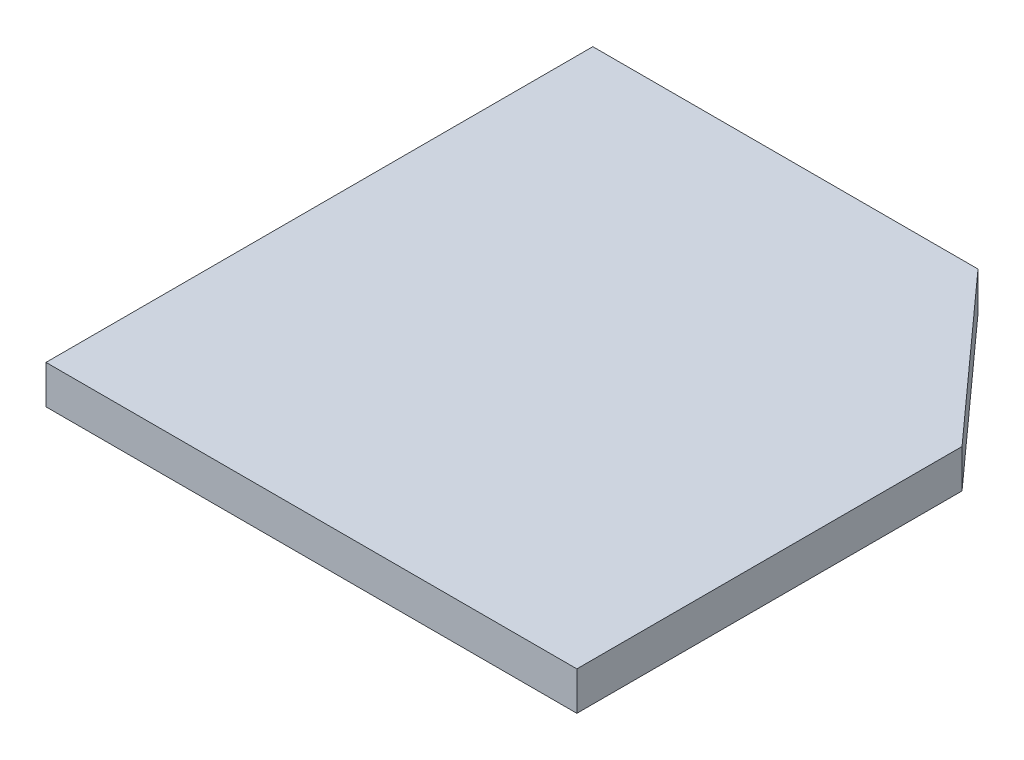
ISO-10303-21;
HEADER;
FILE_DESCRIPTION(('STEP AP214'),'2;1');
FILE_NAME('part.step','',(''),(''),'','','');
FILE_SCHEMA(('AUTOMOTIVE_DESIGN { 1 0 10303 214 1 1 1 1 }'));
ENDSEC;
DATA;
#1=APPLICATION_CONTEXT('core data for automotive mechanical design processes');
#2=APPLICATION_PROTOCOL_DEFINITION('international standard','automotive_design',2000,#1);
#3=PRODUCT_CONTEXT('',#1,'mechanical');
#4=PRODUCT('Part','Part','',(#3));
#5=PRODUCT_RELATED_PRODUCT_CATEGORY('part','',(#4));
#6=PRODUCT_DEFINITION_FORMATION('','',#4);
#7=PRODUCT_DEFINITION_CONTEXT('part definition',#1,'design');
#8=PRODUCT_DEFINITION('design','',#6,#7);
#9=PRODUCT_DEFINITION_SHAPE('','',#8);
#10=(LENGTH_UNIT() NAMED_UNIT(*) SI_UNIT(.MILLI.,.METRE.));
#11=(NAMED_UNIT(*) PLANE_ANGLE_UNIT() SI_UNIT($,.RADIAN.));
#12=(NAMED_UNIT(*) SI_UNIT($,.STERADIAN.) SOLID_ANGLE_UNIT());
#13=UNCERTAINTY_MEASURE_WITH_UNIT(LENGTH_MEASURE(1.E-05),#10,'distance_accuracy_value','');
#14=(GEOMETRIC_REPRESENTATION_CONTEXT(3) GLOBAL_UNCERTAINTY_ASSIGNED_CONTEXT((#13)) GLOBAL_UNIT_ASSIGNED_CONTEXT((#10,
#11,#12)) REPRESENTATION_CONTEXT('',''));
#15=CARTESIAN_POINT('',(0.,0.,0.));
#16=DIRECTION('',(0.,0.,1.));
#17=DIRECTION('',(1.,0.,0.));
#18=AXIS2_PLACEMENT_3D('',#15,#16,#17);
#19=CARTESIAN_POINT('',(0.,5.,0.));
#20=DIRECTION('',(1.,0.,0.));
#21=DIRECTION('',(0.,0.,-1.));
#22=AXIS2_PLACEMENT_3D('',#19,#20,#21);
#23=PLANE('',#22);
#24=DIRECTION('',(0.,0.,1.));
#25=VECTOR('',#24,1.);
#26=CARTESIAN_POINT('',(0.,0.,0.));
#27=LINE('',#26,#25);
#28=CARTESIAN_POINT('',(0.,0.,-70.9876663776316));
#29=VERTEX_POINT('',#28);
#30=CARTESIAN_POINT('',(0.,0.,0.));
#31=VERTEX_POINT('',#30);
#32=EDGE_CURVE('E108',#29,#31,#27,.T.);
#33=ORIENTED_EDGE('',*,*,#32,.T.);
#34=DIRECTION('',(0.,-1.,0.));
#35=VECTOR('',#34,1.);
#36=CARTESIAN_POINT('',(0.,5.,0.));
#37=LINE('',#36,#35);
#38=CARTESIAN_POINT('',(0.,5.,0.));
#39=VERTEX_POINT('',#38);
#40=EDGE_CURVE('E11',#39,#31,#37,.T.);
#41=ORIENTED_EDGE('',*,*,#40,.F.);
#42=DIRECTION('',(0.,0.,1.));
#43=VECTOR('',#42,1.);
#44=CARTESIAN_POINT('',(0.,5.,0.));
#45=LINE('',#44,#43);
#46=CARTESIAN_POINT('',(0.,5.,-70.9876663776316));
#47=VERTEX_POINT('',#46);
#48=EDGE_CURVE('E116',#47,#39,#45,.T.);
#49=ORIENTED_EDGE('',*,*,#48,.F.);
#50=DIRECTION('',(0.,-1.,0.));
#51=VECTOR('',#50,1.);
#52=CARTESIAN_POINT('',(0.,5.,-70.9876663776316));
#53=LINE('',#52,#51);
#54=EDGE_CURVE('E104',#47,#29,#53,.T.);
#55=ORIENTED_EDGE('',*,*,#54,.T.);
#56=EDGE_LOOP('',(#33,#41,#49,#55));
#57=FACE_BOUND('',#56,.T.);
#58=ADVANCED_FACE('F34',(#57),#23,.F.);
#59=CARTESIAN_POINT('',(0.,5.,0.));
#60=DIRECTION('',(0.,0.,-1.));
#61=DIRECTION('',(-1.,0.,0.));
#62=AXIS2_PLACEMENT_3D('',#59,#60,#61);
#63=PLANE('',#62);
#64=DIRECTION('',(1.,0.,0.));
#65=VECTOR('',#64,1.);
#66=CARTESIAN_POINT('',(0.,0.,0.));
#67=LINE('',#66,#65);
#68=CARTESIAN_POINT('',(68.9141987134367,0.,0.));
#69=VERTEX_POINT('',#68);
#70=EDGE_CURVE('E111',#31,#69,#67,.T.);
#71=ORIENTED_EDGE('',*,*,#70,.T.);
#72=DIRECTION('',(0.,-1.,0.));
#73=VECTOR('',#72,1.);
#74=CARTESIAN_POINT('',(68.9141987134367,5.,0.));
#75=LINE('',#74,#73);
#76=CARTESIAN_POINT('',(68.9141987134367,5.,0.));
#77=VERTEX_POINT('',#76);
#78=EDGE_CURVE('E42',#77,#69,#75,.T.);
#79=ORIENTED_EDGE('',*,*,#78,.F.);
#80=DIRECTION('',(1.,0.,0.));
#81=VECTOR('',#80,1.);
#82=CARTESIAN_POINT('',(0.,5.,0.));
#83=LINE('',#82,#81);
#84=EDGE_CURVE('E84',#39,#77,#83,.T.);
#85=ORIENTED_EDGE('',*,*,#84,.F.);
#86=ORIENTED_EDGE('',*,*,#40,.T.);
#87=EDGE_LOOP('',(#71,#79,#85,#86));
#88=FACE_BOUND('',#87,.T.);
#89=ADVANCED_FACE('F135',(#88),#63,.F.);
#90=CARTESIAN_POINT('',(68.9141987134367,5.,0.));
#91=DIRECTION('',(-1.,0.,0.));
#92=DIRECTION('',(0.,0.,1.));
#93=AXIS2_PLACEMENT_3D('',#90,#91,#92);
#94=PLANE('',#93);
#95=DIRECTION('',(0.,0.,-1.));
#96=VECTOR('',#95,1.);
#97=CARTESIAN_POINT('',(68.9141987134367,0.,0.));
#98=LINE('',#97,#96);
#99=CARTESIAN_POINT('',(68.9141987134367,0.,-50.));
#100=VERTEX_POINT('',#99);
#101=EDGE_CURVE('E99',#69,#100,#98,.T.);
#102=ORIENTED_EDGE('',*,*,#101,.T.);
#103=DIRECTION('',(0.,-1.,0.));
#104=VECTOR('',#103,1.);
#105=CARTESIAN_POINT('',(68.9141987134367,5.,-50.));
#106=LINE('',#105,#104);
#107=CARTESIAN_POINT('',(68.9141987134367,5.,-50.));
#108=VERTEX_POINT('',#107);
#109=EDGE_CURVE('E96',#108,#100,#106,.T.);
#110=ORIENTED_EDGE('',*,*,#109,.F.);
#111=DIRECTION('',(0.,0.,-1.));
#112=VECTOR('',#111,1.);
#113=CARTESIAN_POINT('',(68.9141987134367,5.,0.));
#114=LINE('',#113,#112);
#115=EDGE_CURVE('E88',#77,#108,#114,.T.);
#116=ORIENTED_EDGE('',*,*,#115,.F.);
#117=ORIENTED_EDGE('',*,*,#78,.T.);
#118=EDGE_LOOP('',(#102,#110,#116,#117));
#119=FACE_BOUND('',#118,.T.);
#120=ADVANCED_FACE('F97',(#119),#94,.F.);
#121=CARTESIAN_POINT('',(50.,5.,-70.9876663776316));
#122=DIRECTION('',(-0.742848732488238,0.,0.669459304693436));
#123=DIRECTION('',(0.669459304693436,0.,0.742848732488238));
#124=AXIS2_PLACEMENT_3D('',#121,#122,#123);
#125=PLANE('',#124);
#126=DIRECTION('',(-0.669459304693436,0.,-0.742848732488238));
#127=VECTOR('',#126,1.);
#128=CARTESIAN_POINT('',(50.,0.,-70.9876663776316));
#129=LINE('',#128,#127);
#130=CARTESIAN_POINT('',(50.,0.,-70.9876663776316));
#131=VERTEX_POINT('',#130);
#132=EDGE_CURVE('E70',#100,#131,#129,.T.);
#133=ORIENTED_EDGE('',*,*,#132,.T.);
#134=DIRECTION('',(0.,-1.,0.));
#135=VECTOR('',#134,1.);
#136=CARTESIAN_POINT('',(50.,5.,-70.9876663776316));
#137=LINE('',#136,#135);
#138=CARTESIAN_POINT('',(50.,5.,-70.9876663776316));
#139=VERTEX_POINT('',#138);
#140=EDGE_CURVE('E100',#139,#131,#137,.T.);
#141=ORIENTED_EDGE('',*,*,#140,.F.);
#142=DIRECTION('',(-0.669459304693436,0.,-0.742848732488238));
#143=VECTOR('',#142,1.);
#144=CARTESIAN_POINT('',(50.,5.,-70.9876663776316));
#145=LINE('',#144,#143);
#146=EDGE_CURVE('E92',#108,#139,#145,.T.);
#147=ORIENTED_EDGE('',*,*,#146,.F.);
#148=ORIENTED_EDGE('',*,*,#109,.T.);
#149=EDGE_LOOP('',(#133,#141,#147,#148));
#150=FACE_BOUND('',#149,.T.);
#151=ADVANCED_FACE('F102',(#150),#125,.F.);
#152=CARTESIAN_POINT('',(0.,5.,-70.9876663776316));
#153=DIRECTION('',(0.,0.,1.));
#154=DIRECTION('',(1.,0.,0.));
#155=AXIS2_PLACEMENT_3D('',#152,#153,#154);
#156=PLANE('',#155);
#157=DIRECTION('',(-1.,0.,0.));
#158=VECTOR('',#157,1.);
#159=CARTESIAN_POINT('',(0.,0.,-70.9876663776316));
#160=LINE('',#159,#158);
#161=EDGE_CURVE('E76',#131,#29,#160,.T.);
#162=ORIENTED_EDGE('',*,*,#161,.T.);
#163=ORIENTED_EDGE('',*,*,#54,.F.);
#164=DIRECTION('',(-1.,0.,0.));
#165=VECTOR('',#164,1.);
#166=CARTESIAN_POINT('',(0.,5.,-70.9876663776316));
#167=LINE('',#166,#165);
#168=EDGE_CURVE('E50',#139,#47,#167,.T.);
#169=ORIENTED_EDGE('',*,*,#168,.F.);
#170=ORIENTED_EDGE('',*,*,#140,.T.);
#171=EDGE_LOOP('',(#162,#163,#169,#170));
#172=FACE_BOUND('',#171,.T.);
#173=ADVANCED_FACE('F124',(#172),#156,.F.);
#174=CARTESIAN_POINT('',(0.,5.,0.));
#175=DIRECTION('',(0.,-1.,0.));
#176=DIRECTION('',(0.,0.,-1.));
#177=AXIS2_PLACEMENT_3D('',#174,#175,#176);
#178=PLANE('',#177);
#179=ORIENTED_EDGE('',*,*,#48,.T.);
#180=ORIENTED_EDGE('',*,*,#84,.T.);
#181=ORIENTED_EDGE('',*,*,#115,.T.);
#182=ORIENTED_EDGE('',*,*,#146,.T.);
#183=ORIENTED_EDGE('',*,*,#168,.T.);
#184=EDGE_LOOP('',(#179,#180,#181,#182,#183));
#185=FACE_BOUND('',#184,.T.);
#186=ADVANCED_FACE('F90',(#185),#178,.F.);
#187=CARTESIAN_POINT('',(0.,0.,0.));
#188=DIRECTION('',(0.,-1.,0.));
#189=DIRECTION('',(0.,0.,-1.));
#190=AXIS2_PLACEMENT_3D('',#187,#188,#189);
#191=PLANE('',#190);
#192=ORIENTED_EDGE('',*,*,#32,.F.);
#193=ORIENTED_EDGE('',*,*,#161,.F.);
#194=ORIENTED_EDGE('',*,*,#132,.F.);
#195=ORIENTED_EDGE('',*,*,#101,.F.);
#196=ORIENTED_EDGE('',*,*,#70,.F.);
#197=EDGE_LOOP('',(#192,#193,#194,#195,#196));
#198=FACE_BOUND('',#197,.T.);
#199=ADVANCED_FACE('F120',(#198),#191,.T.);
#200=CLOSED_SHELL('',(#58,#89,#120,#151,#173,#186,#199));
#201=MANIFOLD_SOLID_BREP('B2',#200);
#202=ADVANCED_BREP_SHAPE_REPRESENTATION('',(#18,#201),#14);
#203=SHAPE_DEFINITION_REPRESENTATION(#9,#202);
ENDSEC;
END-ISO-10303-21;
